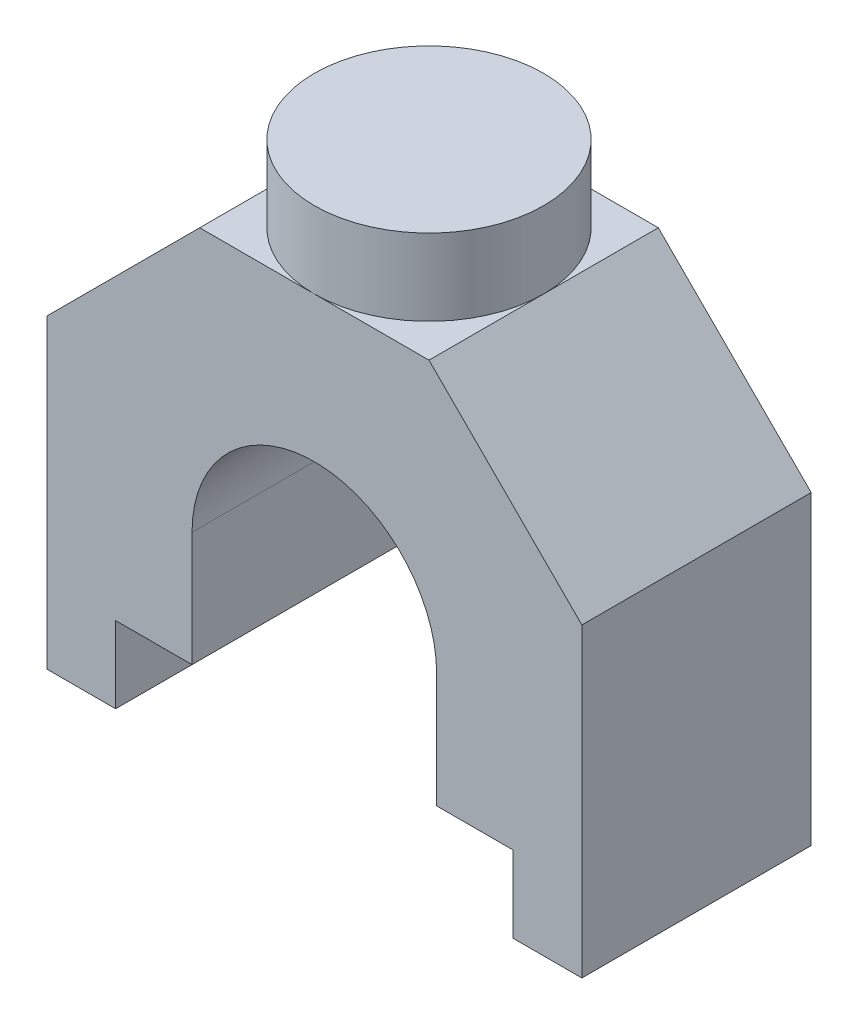
ISO-10303-21;
HEADER;
FILE_DESCRIPTION(('STEP AP214'),'2;1');
FILE_NAME('part.step','',(''),(''),'','','');
FILE_SCHEMA(('AUTOMOTIVE_DESIGN { 1 0 10303 214 1 1 1 1 }'));
ENDSEC;
DATA;
#1=APPLICATION_CONTEXT('core data for automotive mechanical design processes');
#2=APPLICATION_PROTOCOL_DEFINITION('international standard','automotive_design',2000,#1);
#3=PRODUCT_CONTEXT('',#1,'mechanical');
#4=PRODUCT('Part','Part','',(#3));
#5=PRODUCT_RELATED_PRODUCT_CATEGORY('part','',(#4));
#6=PRODUCT_DEFINITION_FORMATION('','',#4);
#7=PRODUCT_DEFINITION_CONTEXT('part definition',#1,'design');
#8=PRODUCT_DEFINITION('design','',#6,#7);
#9=PRODUCT_DEFINITION_SHAPE('','',#8);
#10=(LENGTH_UNIT() NAMED_UNIT(*) SI_UNIT(.MILLI.,.METRE.));
#11=(NAMED_UNIT(*) PLANE_ANGLE_UNIT() SI_UNIT($,.RADIAN.));
#12=(NAMED_UNIT(*) SI_UNIT($,.STERADIAN.) SOLID_ANGLE_UNIT());
#13=UNCERTAINTY_MEASURE_WITH_UNIT(LENGTH_MEASURE(1.E-05),#10,'distance_accuracy_value','');
#14=(GEOMETRIC_REPRESENTATION_CONTEXT(3) GLOBAL_UNCERTAINTY_ASSIGNED_CONTEXT((#13)) GLOBAL_UNIT_ASSIGNED_CONTEXT((#10,
#11,#12)) REPRESENTATION_CONTEXT('',''));
#15=CARTESIAN_POINT('',(0.,0.,0.));
#16=DIRECTION('',(0.,0.,1.));
#17=DIRECTION('',(1.,0.,0.));
#18=AXIS2_PLACEMENT_3D('',#15,#16,#17);
#19=CARTESIAN_POINT('',(5.1,0.,3.));
#20=DIRECTION('',(1.,0.,0.));
#21=DIRECTION('',(0.,1.,0.));
#22=AXIS2_PLACEMENT_3D('',#19,#20,#21);
#23=PLANE('',#22);
#24=DIRECTION('',(0.,0.,-1.));
#25=VECTOR('',#24,1.);
#26=CARTESIAN_POINT('',(5.1,-5.,3.));
#27=LINE('',#26,#25);
#28=CARTESIAN_POINT('',(5.1,-5.,3.));
#29=VERTEX_POINT('',#28);
#30=CARTESIAN_POINT('',(5.1,-5.,0.));
#31=VERTEX_POINT('',#30);
#32=EDGE_CURVE('E50',#29,#31,#27,.T.);
#33=ORIENTED_EDGE('',*,*,#32,.F.);
#34=DIRECTION('',(0.,-1.,0.));
#35=VECTOR('',#34,1.);
#36=CARTESIAN_POINT('',(5.1,0.,3.));
#37=LINE('',#36,#35);
#38=CARTESIAN_POINT('',(5.1,-3.5,3.));
#39=VERTEX_POINT('',#38);
#40=EDGE_CURVE('E231',#39,#29,#37,.T.);
#41=ORIENTED_EDGE('',*,*,#40,.F.);
#42=DIRECTION('',(0.,0.,-1.));
#43=VECTOR('',#42,1.);
#44=CARTESIAN_POINT('',(5.1,-3.5,3.));
#45=LINE('',#44,#43);
#46=CARTESIAN_POINT('',(5.1,-3.5,0.));
#47=VERTEX_POINT('',#46);
#48=EDGE_CURVE('E215',#39,#47,#45,.T.);
#49=ORIENTED_EDGE('',*,*,#48,.T.);
#50=DIRECTION('',(0.,-1.,0.));
#51=VECTOR('',#50,1.);
#52=CARTESIAN_POINT('',(5.1,0.,0.));
#53=LINE('',#52,#51);
#54=EDGE_CURVE('E168',#47,#31,#53,.T.);
#55=ORIENTED_EDGE('',*,*,#54,.T.);
#56=EDGE_LOOP('',(#33,#41,#49,#55));
#57=FACE_BOUND('',#56,.T.);
#58=ADVANCED_FACE('F35',(#57),#23,.F.);
#59=CARTESIAN_POINT('',(1.9,0.,3.));
#60=DIRECTION('',(1.,0.,0.));
#61=DIRECTION('',(0.,1.,0.));
#62=AXIS2_PLACEMENT_3D('',#59,#60,#61);
#63=PLANE('',#62);
#64=DIRECTION('',(0.,-1.,0.));
#65=VECTOR('',#64,1.);
#66=CARTESIAN_POINT('',(1.9,0.,3.));
#67=LINE('',#66,#65);
#68=CARTESIAN_POINT('',(1.9,-3.5,3.));
#69=VERTEX_POINT('',#68);
#70=CARTESIAN_POINT('',(1.9,-5.,3.));
#71=VERTEX_POINT('',#70);
#72=EDGE_CURVE('E199',#69,#71,#67,.T.);
#73=ORIENTED_EDGE('',*,*,#72,.T.);
#74=DIRECTION('',(0.,0.,-1.));
#75=VECTOR('',#74,1.);
#76=CARTESIAN_POINT('',(1.9,-5.,3.));
#77=LINE('',#76,#75);
#78=CARTESIAN_POINT('',(1.9,-5.,0.));
#79=VERTEX_POINT('',#78);
#80=EDGE_CURVE('E269',#71,#79,#77,.T.);
#81=ORIENTED_EDGE('',*,*,#80,.T.);
#82=DIRECTION('',(0.,-1.,0.));
#83=VECTOR('',#82,1.);
#84=CARTESIAN_POINT('',(1.9,0.,0.));
#85=LINE('',#84,#83);
#86=CARTESIAN_POINT('',(1.9,-3.5,0.));
#87=VERTEX_POINT('',#86);
#88=EDGE_CURVE('E177',#87,#79,#85,.T.);
#89=ORIENTED_EDGE('',*,*,#88,.F.);
#90=DIRECTION('',(0.,0.,-1.));
#91=VECTOR('',#90,1.);
#92=CARTESIAN_POINT('',(1.9,-3.5,3.));
#93=LINE('',#92,#91);
#94=EDGE_CURVE('E196',#69,#87,#93,.T.);
#95=ORIENTED_EDGE('',*,*,#94,.F.);
#96=EDGE_LOOP('',(#73,#81,#89,#95));
#97=FACE_BOUND('',#96,.T.);
#98=ADVANCED_FACE('F284',(#97),#63,.T.);
#99=CARTESIAN_POINT('',(0.,0.,3.));
#100=DIRECTION('',(0.,1.,0.));
#101=DIRECTION('',(0.,0.,1.));
#102=AXIS2_PLACEMENT_3D('',#99,#100,#101);
#103=PLANE('',#102);
#104=CARTESIAN_POINT('',(3.5,0.,1.5));
#105=DIRECTION('',(0.,1.,0.));
#106=DIRECTION('',(0.,0.,1.));
#107=AXIS2_PLACEMENT_3D('',#104,#105,#106);
#108=CIRCLE('',#107,1.5);
#109=CARTESIAN_POINT('',(3.5,0.,3.));
#110=VERTEX_POINT('',#109);
#111=CARTESIAN_POINT('',(4.99999999999999,0.,1.5));
#112=VERTEX_POINT('',#111);
#113=EDGE_CURVE('E240',#110,#112,#108,.T.);
#114=ORIENTED_EDGE('',*,*,#113,.F.);
#115=DIRECTION('',(1.,0.,0.));
#116=VECTOR('',#115,1.);
#117=CARTESIAN_POINT('',(0.,0.,3.));
#118=LINE('',#117,#116);
#119=CARTESIAN_POINT('',(4.99999999999999,0.,3.));
#120=VERTEX_POINT('',#119);
#121=EDGE_CURVE('E252',#110,#120,#118,.T.);
#122=ORIENTED_EDGE('',*,*,#121,.T.);
#123=DIRECTION('',(0.,0.,-1.));
#124=VECTOR('',#123,1.);
#125=CARTESIAN_POINT('',(4.99999999999999,0.,3.));
#126=LINE('',#125,#124);
#127=EDGE_CURVE('E208',#120,#112,#126,.T.);
#128=ORIENTED_EDGE('',*,*,#127,.T.);
#129=EDGE_LOOP('',(#114,#122,#128));
#130=FACE_BOUND('',#129,.T.);
#131=ADVANCED_FACE('F322',(#130),#103,.T.);
#132=CARTESIAN_POINT('',(3.5,0.,0.));
#133=VERTEX_POINT('',#132);
#134=EDGE_CURVE('E221',#112,#133,#108,.T.);
#135=ORIENTED_EDGE('',*,*,#134,.F.);
#136=CARTESIAN_POINT('',(4.99999999999999,0.,0.));
#137=VERTEX_POINT('',#136);
#138=EDGE_CURVE('E207',#112,#137,#126,.T.);
#139=ORIENTED_EDGE('',*,*,#138,.T.);
#140=DIRECTION('',(1.,0.,0.));
#141=VECTOR('',#140,1.);
#142=CARTESIAN_POINT('',(0.,0.,0.));
#143=LINE('',#142,#141);
#144=EDGE_CURVE('E306',#133,#137,#143,.T.);
#145=ORIENTED_EDGE('',*,*,#144,.F.);
#146=EDGE_LOOP('',(#135,#139,#145));
#147=FACE_BOUND('',#146,.T.);
#148=ADVANCED_FACE('F327',(#147),#103,.T.);
#149=CARTESIAN_POINT('',(2.00000000000001,0.,1.5));
#150=VERTEX_POINT('',#149);
#151=EDGE_CURVE('E304',#133,#150,#108,.T.);
#152=ORIENTED_EDGE('',*,*,#151,.F.);
#153=CARTESIAN_POINT('',(2.00000000000001,0.,0.));
#154=VERTEX_POINT('',#153);
#155=EDGE_CURVE('E192',#154,#133,#143,.T.);
#156=ORIENTED_EDGE('',*,*,#155,.F.);
#157=DIRECTION('',(0.,0.,-1.));
#158=VECTOR('',#157,1.);
#159=CARTESIAN_POINT('',(2.00000000000001,0.,3.));
#160=LINE('',#159,#158);
#161=EDGE_CURVE('E203',#150,#154,#160,.T.);
#162=ORIENTED_EDGE('',*,*,#161,.F.);
#163=EDGE_LOOP('',(#152,#156,#162));
#164=FACE_BOUND('',#163,.T.);
#165=ADVANCED_FACE('F302',(#164),#103,.T.);
#166=CARTESIAN_POINT('',(3.5,-3.5,3.));
#167=DIRECTION('',(0.,0.,-1.));
#168=DIRECTION('',(-1.,0.,0.));
#169=AXIS2_PLACEMENT_3D('',#166,#167,#168);
#170=CYLINDRICAL_SURFACE('',#169,1.6);
#171=CARTESIAN_POINT('',(3.5,-3.5,0.));
#172=DIRECTION('',(0.,0.,1.));
#173=DIRECTION('',(1.,0.,0.));
#174=AXIS2_PLACEMENT_3D('',#171,#172,#173);
#175=CIRCLE('',#174,1.6);
#176=EDGE_CURVE('E174',#47,#87,#175,.T.);
#177=ORIENTED_EDGE('',*,*,#176,.F.);
#178=ORIENTED_EDGE('',*,*,#48,.F.);
#179=CARTESIAN_POINT('',(3.5,-3.5,3.));
#180=DIRECTION('',(0.,0.,1.));
#181=DIRECTION('',(1.,0.,0.));
#182=AXIS2_PLACEMENT_3D('',#179,#180,#181);
#183=CIRCLE('',#182,1.6);
#184=EDGE_CURVE('E184',#39,#69,#183,.T.);
#185=ORIENTED_EDGE('',*,*,#184,.T.);
#186=ORIENTED_EDGE('',*,*,#94,.T.);
#187=EDGE_LOOP('',(#177,#178,#185,#186));
#188=FACE_BOUND('',#187,.T.);
#189=ADVANCED_FACE('F37',(#188),#170,.F.);
#190=CARTESIAN_POINT('',(0.,-6.,3.));
#191=DIRECTION('',(0.,1.,0.));
#192=DIRECTION('',(0.,0.,1.));
#193=AXIS2_PLACEMENT_3D('',#190,#191,#192);
#194=PLANE('',#193);
#195=DIRECTION('',(1.,0.,0.));
#196=VECTOR('',#195,1.);
#197=CARTESIAN_POINT('',(0.,-6.,3.));
#198=LINE('',#197,#196);
#199=CARTESIAN_POINT('',(6.1,-6.,3.));
#200=VERTEX_POINT('',#199);
#201=CARTESIAN_POINT('',(7.,-6.,3.));
#202=VERTEX_POINT('',#201);
#203=EDGE_CURVE('E161',#200,#202,#198,.T.);
#204=ORIENTED_EDGE('',*,*,#203,.F.);
#205=DIRECTION('',(0.,0.,1.));
#206=VECTOR('',#205,1.);
#207=CARTESIAN_POINT('',(6.1,-6.,3.92205541882351));
#208=LINE('',#207,#206);
#209=CARTESIAN_POINT('',(6.1,-6.,0.));
#210=VERTEX_POINT('',#209);
#211=EDGE_CURVE('E149',#210,#200,#208,.T.);
#212=ORIENTED_EDGE('',*,*,#211,.F.);
#213=DIRECTION('',(1.,0.,0.));
#214=VECTOR('',#213,1.);
#215=CARTESIAN_POINT('',(0.,-6.,0.));
#216=LINE('',#215,#214);
#217=CARTESIAN_POINT('',(7.,-6.,0.));
#218=VERTEX_POINT('',#217);
#219=EDGE_CURVE('E159',#210,#218,#216,.T.);
#220=ORIENTED_EDGE('',*,*,#219,.T.);
#221=DIRECTION('',(0.,0.,-1.));
#222=VECTOR('',#221,1.);
#223=CARTESIAN_POINT('',(7.,-6.,3.));
#224=LINE('',#223,#222);
#225=EDGE_CURVE('E213',#202,#218,#224,.T.);
#226=ORIENTED_EDGE('',*,*,#225,.F.);
#227=EDGE_LOOP('',(#204,#212,#220,#226));
#228=FACE_BOUND('',#227,.T.);
#229=ADVANCED_FACE('F157',(#228),#194,.F.);
#230=CARTESIAN_POINT('',(7.,0.,3.));
#231=DIRECTION('',(1.,0.,0.));
#232=DIRECTION('',(0.,1.,0.));
#233=AXIS2_PLACEMENT_3D('',#230,#231,#232);
#234=PLANE('',#233);
#235=DIRECTION('',(0.,-1.,0.));
#236=VECTOR('',#235,1.);
#237=CARTESIAN_POINT('',(7.,0.,0.));
#238=LINE('',#237,#236);
#239=CARTESIAN_POINT('',(7.,-2.00000000000001,0.));
#240=VERTEX_POINT('',#239);
#241=EDGE_CURVE('E167',#240,#218,#238,.T.);
#242=ORIENTED_EDGE('',*,*,#241,.F.);
#243=DIRECTION('',(0.,0.,-1.));
#244=VECTOR('',#243,1.);
#245=CARTESIAN_POINT('',(7.,-2.00000000000001,3.));
#246=LINE('',#245,#244);
#247=CARTESIAN_POINT('',(7.,-2.00000000000001,3.));
#248=VERTEX_POINT('',#247);
#249=EDGE_CURVE('E211',#248,#240,#246,.T.);
#250=ORIENTED_EDGE('',*,*,#249,.F.);
#251=DIRECTION('',(0.,-1.,0.));
#252=VECTOR('',#251,1.);
#253=CARTESIAN_POINT('',(7.,0.,3.));
#254=LINE('',#253,#252);
#255=EDGE_CURVE('E256',#248,#202,#254,.T.);
#256=ORIENTED_EDGE('',*,*,#255,.T.);
#257=ORIENTED_EDGE('',*,*,#225,.T.);
#258=EDGE_LOOP('',(#242,#250,#256,#257));
#259=FACE_BOUND('',#258,.T.);
#260=ADVANCED_FACE('F316',(#259),#234,.T.);
#261=CARTESIAN_POINT('',(2.49999999999999,2.49999999999999,3.));
#262=DIRECTION('',(0.707106781186547,0.707106781186547,0.));
#263=DIRECTION('',(-0.707106781186548,0.707106781186548,0.));
#264=AXIS2_PLACEMENT_3D('',#261,#262,#263);
#265=PLANE('',#264);
#266=DIRECTION('',(0.707106781186548,-0.707106781186548,0.));
#267=VECTOR('',#266,1.);
#268=CARTESIAN_POINT('',(2.49999999999999,2.49999999999999,0.));
#269=LINE('',#268,#267);
#270=EDGE_CURVE('E171',#137,#240,#269,.T.);
#271=ORIENTED_EDGE('',*,*,#270,.F.);
#272=ORIENTED_EDGE('',*,*,#138,.F.);
#273=ORIENTED_EDGE('',*,*,#127,.F.);
#274=DIRECTION('',(0.707106781186548,-0.707106781186548,0.));
#275=VECTOR('',#274,1.);
#276=CARTESIAN_POINT('',(2.49999999999999,2.49999999999999,3.));
#277=LINE('',#276,#275);
#278=EDGE_CURVE('E253',#120,#248,#277,.T.);
#279=ORIENTED_EDGE('',*,*,#278,.T.);
#280=ORIENTED_EDGE('',*,*,#249,.T.);
#281=EDGE_LOOP('',(#271,#272,#273,#279,#280));
#282=FACE_BOUND('',#281,.T.);
#283=ADVANCED_FACE('F311',(#282),#265,.T.);
#284=EDGE_CURVE('E217',#150,#110,#108,.T.);
#285=ORIENTED_EDGE('',*,*,#284,.F.);
#286=CARTESIAN_POINT('',(2.00000000000001,0.,3.));
#287=VERTEX_POINT('',#286);
#288=EDGE_CURVE('E204',#287,#150,#160,.T.);
#289=ORIENTED_EDGE('',*,*,#288,.F.);
#290=EDGE_CURVE('E250',#287,#110,#118,.T.);
#291=ORIENTED_EDGE('',*,*,#290,.T.);
#292=EDGE_LOOP('',(#285,#289,#291));
#293=FACE_BOUND('',#292,.T.);
#294=ADVANCED_FACE('F334',(#293),#103,.T.);
#295=CARTESIAN_POINT('',(1.00000000000001,-1.00000000000001,3.));
#296=DIRECTION('',(0.707106781186547,-0.707106781186547,0.));
#297=DIRECTION('',(0.707106781186548,0.707106781186548,0.));
#298=AXIS2_PLACEMENT_3D('',#295,#296,#297);
#299=PLANE('',#298);
#300=DIRECTION('',(-0.707106781186548,-0.707106781186548,0.));
#301=VECTOR('',#300,1.);
#302=CARTESIAN_POINT('',(1.00000000000001,-1.00000000000001,0.));
#303=LINE('',#302,#301);
#304=CARTESIAN_POINT('',(0.,-2.00000000000001,0.));
#305=VERTEX_POINT('',#304);
#306=EDGE_CURVE('E186',#154,#305,#303,.T.);
#307=ORIENTED_EDGE('',*,*,#306,.T.);
#308=DIRECTION('',(0.,0.,-1.));
#309=VECTOR('',#308,1.);
#310=CARTESIAN_POINT('',(0.,-2.00000000000001,3.));
#311=LINE('',#310,#309);
#312=CARTESIAN_POINT('',(0.,-2.00000000000001,3.));
#313=VERTEX_POINT('',#312);
#314=EDGE_CURVE('E201',#313,#305,#311,.T.);
#315=ORIENTED_EDGE('',*,*,#314,.F.);
#316=DIRECTION('',(-0.707106781186548,-0.707106781186548,0.));
#317=VECTOR('',#316,1.);
#318=CARTESIAN_POINT('',(1.00000000000001,-1.00000000000001,3.));
#319=LINE('',#318,#317);
#320=EDGE_CURVE('E248',#287,#313,#319,.T.);
#321=ORIENTED_EDGE('',*,*,#320,.F.);
#322=ORIENTED_EDGE('',*,*,#288,.T.);
#323=ORIENTED_EDGE('',*,*,#161,.T.);
#324=EDGE_LOOP('',(#307,#315,#321,#322,#323));
#325=FACE_BOUND('',#324,.T.);
#326=ADVANCED_FACE('F348',(#325),#299,.F.);
#327=CARTESIAN_POINT('',(0.,0.,3.));
#328=DIRECTION('',(1.,0.,0.));
#329=DIRECTION('',(0.,1.,0.));
#330=AXIS2_PLACEMENT_3D('',#327,#328,#329);
#331=PLANE('',#330);
#332=DIRECTION('',(0.,-1.,0.));
#333=VECTOR('',#332,1.);
#334=CARTESIAN_POINT('',(0.,0.,0.));
#335=LINE('',#334,#333);
#336=CARTESIAN_POINT('',(0.,-6.,0.));
#337=VERTEX_POINT('',#336);
#338=EDGE_CURVE('E178',#305,#337,#335,.T.);
#339=ORIENTED_EDGE('',*,*,#338,.T.);
#340=DIRECTION('',(0.,0.,-1.));
#341=VECTOR('',#340,1.);
#342=CARTESIAN_POINT('',(0.,-6.,3.));
#343=LINE('',#342,#341);
#344=CARTESIAN_POINT('',(0.,-6.,3.));
#345=VERTEX_POINT('',#344);
#346=EDGE_CURVE('E198',#345,#337,#343,.T.);
#347=ORIENTED_EDGE('',*,*,#346,.F.);
#348=DIRECTION('',(0.,-1.,0.));
#349=VECTOR('',#348,1.);
#350=CARTESIAN_POINT('',(0.,0.,3.));
#351=LINE('',#350,#349);
#352=EDGE_CURVE('E246',#313,#345,#351,.T.);
#353=ORIENTED_EDGE('',*,*,#352,.F.);
#354=ORIENTED_EDGE('',*,*,#314,.T.);
#355=EDGE_LOOP('',(#339,#347,#353,#354));
#356=FACE_BOUND('',#355,.T.);
#357=ADVANCED_FACE('F352',(#356),#331,.F.);
#358=CARTESIAN_POINT('',(0.900000000000001,-6.,0.));
#359=VERTEX_POINT('',#358);
#360=EDGE_CURVE('E170',#337,#359,#216,.T.);
#361=ORIENTED_EDGE('',*,*,#360,.T.);
#362=DIRECTION('',(0.,0.,-1.));
#363=VECTOR('',#362,1.);
#364=CARTESIAN_POINT('',(0.9,-6.,3.72713590672743));
#365=LINE('',#364,#363);
#366=CARTESIAN_POINT('',(0.900000000000001,-6.,3.));
#367=VERTEX_POINT('',#366);
#368=EDGE_CURVE('E272',#367,#359,#365,.T.);
#369=ORIENTED_EDGE('',*,*,#368,.F.);
#370=EDGE_CURVE('E245',#345,#367,#198,.T.);
#371=ORIENTED_EDGE('',*,*,#370,.F.);
#372=ORIENTED_EDGE('',*,*,#346,.T.);
#373=EDGE_LOOP('',(#361,#369,#371,#372));
#374=FACE_BOUND('',#373,.T.);
#375=ADVANCED_FACE('F292',(#374),#194,.F.);
#376=CARTESIAN_POINT('',(0.,0.,3.));
#377=DIRECTION('',(0.,0.,1.));
#378=DIRECTION('',(1.,0.,0.));
#379=AXIS2_PLACEMENT_3D('',#376,#377,#378);
#380=PLANE('',#379);
#381=DIRECTION('',(0.,1.,0.));
#382=VECTOR('',#381,1.);
#383=CARTESIAN_POINT('',(6.1,0.,3.));
#384=LINE('',#383,#382);
#385=CARTESIAN_POINT('',(6.1,-5.,3.));
#386=VERTEX_POINT('',#385);
#387=EDGE_CURVE('E274',#200,#386,#384,.T.);
#388=ORIENTED_EDGE('',*,*,#387,.F.);
#389=ORIENTED_EDGE('',*,*,#203,.T.);
#390=ORIENTED_EDGE('',*,*,#255,.F.);
#391=ORIENTED_EDGE('',*,*,#278,.F.);
#392=ORIENTED_EDGE('',*,*,#121,.F.);
#393=ORIENTED_EDGE('',*,*,#290,.F.);
#394=ORIENTED_EDGE('',*,*,#320,.T.);
#395=ORIENTED_EDGE('',*,*,#352,.T.);
#396=ORIENTED_EDGE('',*,*,#370,.T.);
#397=DIRECTION('',(0.,-1.,0.));
#398=VECTOR('',#397,1.);
#399=CARTESIAN_POINT('',(0.900000000000001,0.,3.));
#400=LINE('',#399,#398);
#401=CARTESIAN_POINT('',(0.900000000000001,-5.,3.));
#402=VERTEX_POINT('',#401);
#403=EDGE_CURVE('E263',#402,#367,#400,.T.);
#404=ORIENTED_EDGE('',*,*,#403,.F.);
#405=DIRECTION('',(1.,0.,0.));
#406=VECTOR('',#405,1.);
#407=CARTESIAN_POINT('',(0.,-5.,3.));
#408=LINE('',#407,#406);
#409=EDGE_CURVE('E266',#402,#71,#408,.T.);
#410=ORIENTED_EDGE('',*,*,#409,.T.);
#411=ORIENTED_EDGE('',*,*,#72,.F.);
#412=ORIENTED_EDGE('',*,*,#184,.F.);
#413=ORIENTED_EDGE('',*,*,#40,.T.);
#414=DIRECTION('',(1.,0.,0.));
#415=VECTOR('',#414,1.);
#416=CARTESIAN_POINT('',(0.,-5.,3.));
#417=LINE('',#416,#415);
#418=EDGE_CURVE('E277',#29,#386,#417,.T.);
#419=ORIENTED_EDGE('',*,*,#418,.T.);
#420=EDGE_LOOP('',(#388,#389,#390,#391,#392,#393,#394,#395,#396,#404,#410,#411,#412,#413,#419));
#421=FACE_BOUND('',#420,.T.);
#422=ADVANCED_FACE('F281',(#421),#380,.T.);
#423=CARTESIAN_POINT('',(0.,0.,0.));
#424=DIRECTION('',(0.,0.,1.));
#425=DIRECTION('',(1.,0.,0.));
#426=AXIS2_PLACEMENT_3D('',#423,#424,#425);
#427=PLANE('',#426);
#428=ORIENTED_EDGE('',*,*,#219,.F.);
#429=DIRECTION('',(0.,1.,0.));
#430=VECTOR('',#429,1.);
#431=CARTESIAN_POINT('',(6.1,0.,0.));
#432=LINE('',#431,#430);
#433=CARTESIAN_POINT('',(6.1,-5.,0.));
#434=VERTEX_POINT('',#433);
#435=EDGE_CURVE('E11',#210,#434,#432,.T.);
#436=ORIENTED_EDGE('',*,*,#435,.T.);
#437=DIRECTION('',(1.,0.,0.));
#438=VECTOR('',#437,1.);
#439=CARTESIAN_POINT('',(0.,-5.,0.));
#440=LINE('',#439,#438);
#441=EDGE_CURVE('E43',#31,#434,#440,.T.);
#442=ORIENTED_EDGE('',*,*,#441,.F.);
#443=ORIENTED_EDGE('',*,*,#54,.F.);
#444=ORIENTED_EDGE('',*,*,#176,.T.);
#445=ORIENTED_EDGE('',*,*,#88,.T.);
#446=DIRECTION('',(1.,0.,0.));
#447=VECTOR('',#446,1.);
#448=CARTESIAN_POINT('',(0.,-5.,0.));
#449=LINE('',#448,#447);
#450=CARTESIAN_POINT('',(0.9,-5.,0.));
#451=VERTEX_POINT('',#450);
#452=EDGE_CURVE('E218',#451,#79,#449,.T.);
#453=ORIENTED_EDGE('',*,*,#452,.F.);
#454=DIRECTION('',(0.,-1.,0.));
#455=VECTOR('',#454,1.);
#456=CARTESIAN_POINT('',(0.900000000000001,0.,0.));
#457=LINE('',#456,#455);
#458=EDGE_CURVE('E220',#451,#359,#457,.T.);
#459=ORIENTED_EDGE('',*,*,#458,.T.);
#460=ORIENTED_EDGE('',*,*,#360,.F.);
#461=ORIENTED_EDGE('',*,*,#338,.F.);
#462=ORIENTED_EDGE('',*,*,#306,.F.);
#463=ORIENTED_EDGE('',*,*,#155,.T.);
#464=ORIENTED_EDGE('',*,*,#144,.T.);
#465=ORIENTED_EDGE('',*,*,#270,.T.);
#466=ORIENTED_EDGE('',*,*,#241,.T.);
#467=EDGE_LOOP('',(#428,#436,#442,#443,#444,#445,#453,#459,#460,#461,#462,#463,#464,#465,#466));
#468=FACE_BOUND('',#467,.T.);
#469=ADVANCED_FACE('F164',(#468),#427,.F.);
#470=CARTESIAN_POINT('',(3.5,1.,1.5));
#471=DIRECTION('',(0.,-1.,0.));
#472=DIRECTION('',(0.,0.,-1.));
#473=AXIS2_PLACEMENT_3D('',#470,#471,#472);
#474=CYLINDRICAL_SURFACE('',#473,1.5);
#475=CARTESIAN_POINT('',(3.5,1.,1.5));
#476=DIRECTION('',(0.,1.,0.));
#477=DIRECTION('',(0.,0.,1.));
#478=AXIS2_PLACEMENT_3D('',#475,#476,#477);
#479=CIRCLE('',#478,1.5);
#480=CARTESIAN_POINT('',(3.5,1.,3.));
#481=VERTEX_POINT('',#480);
#482=EDGE_CURVE('E237',#481,#481,#479,.T.);
#483=ORIENTED_EDGE('',*,*,#482,.F.);
#484=EDGE_LOOP('',(#483));
#485=FACE_BOUND('',#484,.T.);
#486=ORIENTED_EDGE('',*,*,#113,.T.);
#487=ORIENTED_EDGE('',*,*,#134,.T.);
#488=ORIENTED_EDGE('',*,*,#151,.T.);
#489=ORIENTED_EDGE('',*,*,#284,.T.);
#490=EDGE_LOOP('',(#486,#487,#488,#489));
#491=FACE_BOUND('',#490,.T.);
#492=ADVANCED_FACE('F324',(#485,#491),#474,.T.);
#493=CARTESIAN_POINT('',(3.5,1.,1.5));
#494=DIRECTION('',(0.,1.,0.));
#495=DIRECTION('',(0.,0.,1.));
#496=AXIS2_PLACEMENT_3D('',#493,#494,#495);
#497=PLANE('',#496);
#498=ORIENTED_EDGE('',*,*,#482,.T.);
#499=EDGE_LOOP('',(#498));
#500=FACE_BOUND('',#499,.T.);
#501=ADVANCED_FACE('F366',(#500),#497,.T.);
#502=CARTESIAN_POINT('',(0.9,-5.,3.72713590672743));
#503=DIRECTION('',(-1.,0.,0.));
#504=DIRECTION('',(0.,0.,1.));
#505=AXIS2_PLACEMENT_3D('',#502,#503,#504);
#506=PLANE('',#505);
#507=ORIENTED_EDGE('',*,*,#403,.T.);
#508=ORIENTED_EDGE('',*,*,#368,.T.);
#509=ORIENTED_EDGE('',*,*,#458,.F.);
#510=DIRECTION('',(0.,0.,-1.));
#511=VECTOR('',#510,1.);
#512=CARTESIAN_POINT('',(0.9,-5.,3.72713590672743));
#513=LINE('',#512,#511);
#514=EDGE_CURVE('E58',#402,#451,#513,.T.);
#515=ORIENTED_EDGE('',*,*,#514,.F.);
#516=EDGE_LOOP('',(#507,#508,#509,#515));
#517=FACE_BOUND('',#516,.T.);
#518=ADVANCED_FACE('F288',(#517),#506,.F.);
#519=CARTESIAN_POINT('',(0.,-5.,0.));
#520=DIRECTION('',(0.,-1.,0.));
#521=DIRECTION('',(0.,0.,-1.));
#522=AXIS2_PLACEMENT_3D('',#519,#520,#521);
#523=PLANE('',#522);
#524=ORIENTED_EDGE('',*,*,#514,.T.);
#525=ORIENTED_EDGE('',*,*,#452,.T.);
#526=ORIENTED_EDGE('',*,*,#80,.F.);
#527=ORIENTED_EDGE('',*,*,#409,.F.);
#528=EDGE_LOOP('',(#524,#525,#526,#527));
#529=FACE_BOUND('',#528,.T.);
#530=ADVANCED_FACE('F286',(#529),#523,.T.);
#531=CARTESIAN_POINT('',(6.1,-5.,3.92205541882351));
#532=DIRECTION('',(1.,0.,0.));
#533=DIRECTION('',(0.,0.,-1.));
#534=AXIS2_PLACEMENT_3D('',#531,#532,#533);
#535=PLANE('',#534);
#536=ORIENTED_EDGE('',*,*,#387,.T.);
#537=DIRECTION('',(0.,0.,1.));
#538=VECTOR('',#537,1.);
#539=CARTESIAN_POINT('',(6.1,-5.,3.92205541882351));
#540=LINE('',#539,#538);
#541=EDGE_CURVE('E152',#434,#386,#540,.T.);
#542=ORIENTED_EDGE('',*,*,#541,.F.);
#543=ORIENTED_EDGE('',*,*,#435,.F.);
#544=ORIENTED_EDGE('',*,*,#211,.T.);
#545=EDGE_LOOP('',(#536,#542,#543,#544));
#546=FACE_BOUND('',#545,.T.);
#547=ADVANCED_FACE('F148',(#546),#535,.F.);
#548=CARTESIAN_POINT('',(0.,-5.,0.));
#549=DIRECTION('',(0.,-1.,0.));
#550=DIRECTION('',(0.,0.,-1.));
#551=AXIS2_PLACEMENT_3D('',#548,#549,#550);
#552=PLANE('',#551);
#553=ORIENTED_EDGE('',*,*,#32,.T.);
#554=ORIENTED_EDGE('',*,*,#441,.T.);
#555=ORIENTED_EDGE('',*,*,#541,.T.);
#556=ORIENTED_EDGE('',*,*,#418,.F.);
#557=EDGE_LOOP('',(#553,#554,#555,#556));
#558=FACE_BOUND('',#557,.T.);
#559=ADVANCED_FACE('F223',(#558),#552,.T.);
#560=CLOSED_SHELL('',(#58,#98,#131,#148,#165,#189,#229,#260,#283,#294,#326,#357,#375,#422,#469,
#492,#501,#518,#530,#547,#559));
#561=MANIFOLD_SOLID_BREP('B2',#560);
#562=ADVANCED_BREP_SHAPE_REPRESENTATION('',(#18,#561),#14);
#563=SHAPE_DEFINITION_REPRESENTATION(#9,#562);
ENDSEC;
END-ISO-10303-21;
